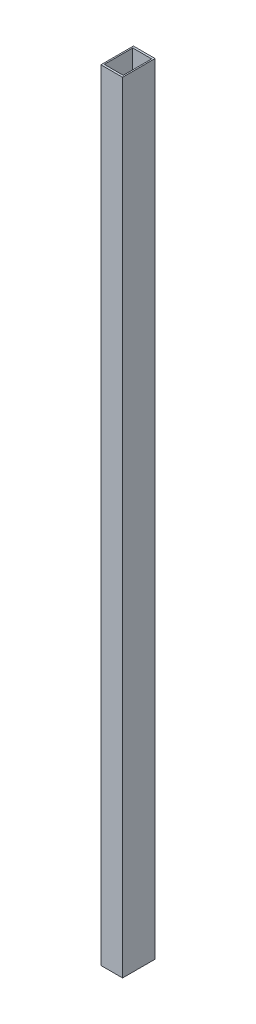
ISO-10303-21;
HEADER;
FILE_DESCRIPTION(('STEP AP214'),'2;1');
FILE_NAME('part.step','',(''),(''),'','','');
FILE_SCHEMA(('AUTOMOTIVE_DESIGN { 1 0 10303 214 1 1 1 1 }'));
ENDSEC;
DATA;
#1=APPLICATION_CONTEXT('core data for automotive mechanical design processes');
#2=APPLICATION_PROTOCOL_DEFINITION('international standard','automotive_design',2000,#1);
#3=PRODUCT_CONTEXT('',#1,'mechanical');
#4=PRODUCT('Part','Part','',(#3));
#5=PRODUCT_RELATED_PRODUCT_CATEGORY('part','',(#4));
#6=PRODUCT_DEFINITION_FORMATION('','',#4);
#7=PRODUCT_DEFINITION_CONTEXT('part definition',#1,'design');
#8=PRODUCT_DEFINITION('design','',#6,#7);
#9=PRODUCT_DEFINITION_SHAPE('','',#8);
#10=(LENGTH_UNIT() NAMED_UNIT(*) SI_UNIT(.MILLI.,.METRE.));
#11=(NAMED_UNIT(*) PLANE_ANGLE_UNIT() SI_UNIT($,.RADIAN.));
#12=(NAMED_UNIT(*) SI_UNIT($,.STERADIAN.) SOLID_ANGLE_UNIT());
#13=UNCERTAINTY_MEASURE_WITH_UNIT(LENGTH_MEASURE(1.E-05),#10,'distance_accuracy_value','');
#14=(GEOMETRIC_REPRESENTATION_CONTEXT(3) GLOBAL_UNCERTAINTY_ASSIGNED_CONTEXT((#13)) GLOBAL_UNIT_ASSIGNED_CONTEXT((#10,
#11,#12)) REPRESENTATION_CONTEXT('',''));
#15=CARTESIAN_POINT('',(0.,0.,0.));
#16=DIRECTION('',(0.,0.,1.));
#17=DIRECTION('',(1.,0.,0.));
#18=AXIS2_PLACEMENT_3D('',#15,#16,#17);
#19=CARTESIAN_POINT('',(-25.4,0.,-38.1));
#20=DIRECTION('',(-1.,0.,0.));
#21=DIRECTION('',(0.,0.,1.));
#22=AXIS2_PLACEMENT_3D('',#19,#20,#21);
#23=PLANE('',#22);
#24=DIRECTION('',(0.,1.,0.));
#25=VECTOR('',#24,1.);
#26=CARTESIAN_POINT('',(-25.4,0.,-38.1));
#27=LINE('',#26,#25);
#28=CARTESIAN_POINT('',(-25.4,0.,-38.1));
#29=VERTEX_POINT('',#28);
#30=CARTESIAN_POINT('',(-25.4,1828.8,-38.1));
#31=VERTEX_POINT('',#30);
#32=EDGE_CURVE('E114',#29,#31,#27,.T.);
#33=ORIENTED_EDGE('',*,*,#32,.F.);
#34=DIRECTION('',(0.,0.,1.));
#35=VECTOR('',#34,1.);
#36=CARTESIAN_POINT('',(-25.4,0.,0.));
#37=LINE('',#36,#35);
#38=CARTESIAN_POINT('',(-25.4,0.,38.1));
#39=VERTEX_POINT('',#38);
#40=EDGE_CURVE('E136',#29,#39,#37,.T.);
#41=ORIENTED_EDGE('',*,*,#40,.T.);
#42=DIRECTION('',(0.,1.,0.));
#43=VECTOR('',#42,1.);
#44=CARTESIAN_POINT('',(-25.4,0.,38.1));
#45=LINE('',#44,#43);
#46=CARTESIAN_POINT('',(-25.4,1828.8,38.1));
#47=VERTEX_POINT('',#46);
#48=EDGE_CURVE('E131',#47,#39,#45,.F.);
#49=ORIENTED_EDGE('',*,*,#48,.F.);
#50=DIRECTION('',(0.,0.,1.));
#51=VECTOR('',#50,1.);
#52=CARTESIAN_POINT('',(-25.4,1828.8,0.));
#53=LINE('',#52,#51);
#54=EDGE_CURVE('E109',#31,#47,#53,.T.);
#55=ORIENTED_EDGE('',*,*,#54,.F.);
#56=EDGE_LOOP('',(#33,#41,#49,#55));
#57=FACE_BOUND('',#56,.T.);
#58=ADVANCED_FACE('F17',(#57),#23,.T.);
#59=CARTESIAN_POINT('',(22.225,0.,-33.3375));
#60=DIRECTION('',(-1.,0.,0.));
#61=DIRECTION('',(0.,0.,1.));
#62=AXIS2_PLACEMENT_3D('',#59,#60,#61);
#63=PLANE('',#62);
#64=DIRECTION('',(0.,1.,0.));
#65=VECTOR('',#64,1.);
#66=CARTESIAN_POINT('',(22.225,0.,-33.3375));
#67=LINE('',#66,#65);
#68=CARTESIAN_POINT('',(22.225,0.,-33.3375));
#69=VERTEX_POINT('',#68);
#70=CARTESIAN_POINT('',(22.225,1828.8,-33.3375));
#71=VERTEX_POINT('',#70);
#72=EDGE_CURVE('E91',#69,#71,#67,.T.);
#73=ORIENTED_EDGE('',*,*,#72,.F.);
#74=DIRECTION('',(0.,0.,1.));
#75=VECTOR('',#74,1.);
#76=CARTESIAN_POINT('',(22.225,0.,0.));
#77=LINE('',#76,#75);
#78=CARTESIAN_POINT('',(22.225,0.,33.3375));
#79=VERTEX_POINT('',#78);
#80=EDGE_CURVE('E139',#69,#79,#77,.T.);
#81=ORIENTED_EDGE('',*,*,#80,.T.);
#82=DIRECTION('',(0.,1.,0.));
#83=VECTOR('',#82,1.);
#84=CARTESIAN_POINT('',(22.225,0.,33.3375));
#85=LINE('',#84,#83);
#86=CARTESIAN_POINT('',(22.225,1828.8,33.3375));
#87=VERTEX_POINT('',#86);
#88=EDGE_CURVE('E20',#87,#79,#85,.F.);
#89=ORIENTED_EDGE('',*,*,#88,.F.);
#90=DIRECTION('',(0.,0.,1.));
#91=VECTOR('',#90,1.);
#92=CARTESIAN_POINT('',(22.225,1828.8,0.));
#93=LINE('',#92,#91);
#94=EDGE_CURVE('E105',#71,#87,#93,.T.);
#95=ORIENTED_EDGE('',*,*,#94,.F.);
#96=EDGE_LOOP('',(#73,#81,#89,#95));
#97=FACE_BOUND('',#96,.T.);
#98=ADVANCED_FACE('F125',(#97),#63,.T.);
#99=CARTESIAN_POINT('',(22.225,0.,33.3375));
#100=DIRECTION('',(0.,0.,-1.));
#101=DIRECTION('',(-1.,0.,0.));
#102=AXIS2_PLACEMENT_3D('',#99,#100,#101);
#103=PLANE('',#102);
#104=ORIENTED_EDGE('',*,*,#88,.T.);
#105=DIRECTION('',(1.,0.,0.));
#106=VECTOR('',#105,1.);
#107=CARTESIAN_POINT('',(0.,0.,33.3375));
#108=LINE('',#107,#106);
#109=CARTESIAN_POINT('',(-22.225,0.,33.3375));
#110=VERTEX_POINT('',#109);
#111=EDGE_CURVE('E88',#79,#110,#108,.F.);
#112=ORIENTED_EDGE('',*,*,#111,.T.);
#113=DIRECTION('',(0.,1.,0.));
#114=VECTOR('',#113,1.);
#115=CARTESIAN_POINT('',(-22.225,0.,33.3375));
#116=LINE('',#115,#114);
#117=CARTESIAN_POINT('',(-22.225,1828.8,33.3375));
#118=VERTEX_POINT('',#117);
#119=EDGE_CURVE('E80',#118,#110,#116,.F.);
#120=ORIENTED_EDGE('',*,*,#119,.F.);
#121=DIRECTION('',(1.,0.,0.));
#122=VECTOR('',#121,1.);
#123=CARTESIAN_POINT('',(0.,1828.8,33.3375));
#124=LINE('',#123,#122);
#125=EDGE_CURVE('E85',#87,#118,#124,.F.);
#126=ORIENTED_EDGE('',*,*,#125,.F.);
#127=EDGE_LOOP('',(#104,#112,#120,#126));
#128=FACE_BOUND('',#127,.T.);
#129=ADVANCED_FACE('F83',(#128),#103,.T.);
#130=CARTESIAN_POINT('',(-22.225,0.,33.3375));
#131=DIRECTION('',(1.,0.,0.));
#132=DIRECTION('',(0.,0.,-1.));
#133=AXIS2_PLACEMENT_3D('',#130,#131,#132);
#134=PLANE('',#133);
#135=ORIENTED_EDGE('',*,*,#119,.T.);
#136=DIRECTION('',(0.,0.,1.));
#137=VECTOR('',#136,1.);
#138=CARTESIAN_POINT('',(-22.225,0.,0.));
#139=LINE('',#138,#137);
#140=CARTESIAN_POINT('',(-22.225,0.,-33.3375));
#141=VERTEX_POINT('',#140);
#142=EDGE_CURVE('E142',#110,#141,#139,.F.);
#143=ORIENTED_EDGE('',*,*,#142,.T.);
#144=DIRECTION('',(0.,1.,0.));
#145=VECTOR('',#144,1.);
#146=CARTESIAN_POINT('',(-22.225,0.,-33.3375));
#147=LINE('',#146,#145);
#148=CARTESIAN_POINT('',(-22.225,1828.8,-33.3375));
#149=VERTEX_POINT('',#148);
#150=EDGE_CURVE('E96',#149,#141,#147,.F.);
#151=ORIENTED_EDGE('',*,*,#150,.F.);
#152=DIRECTION('',(0.,0.,1.));
#153=VECTOR('',#152,1.);
#154=CARTESIAN_POINT('',(-22.225,1828.8,0.));
#155=LINE('',#154,#153);
#156=EDGE_CURVE('E93',#118,#149,#155,.F.);
#157=ORIENTED_EDGE('',*,*,#156,.F.);
#158=EDGE_LOOP('',(#135,#143,#151,#157));
#159=FACE_BOUND('',#158,.T.);
#160=ADVANCED_FACE('F94',(#159),#134,.T.);
#161=CARTESIAN_POINT('',(-22.225,0.,-33.3375));
#162=DIRECTION('',(0.,0.,1.));
#163=DIRECTION('',(1.,0.,0.));
#164=AXIS2_PLACEMENT_3D('',#161,#162,#163);
#165=PLANE('',#164);
#166=ORIENTED_EDGE('',*,*,#150,.T.);
#167=DIRECTION('',(1.,0.,0.));
#168=VECTOR('',#167,1.);
#169=CARTESIAN_POINT('',(0.,0.,-33.3375));
#170=LINE('',#169,#168);
#171=EDGE_CURVE('E122',#141,#69,#170,.T.);
#172=ORIENTED_EDGE('',*,*,#171,.T.);
#173=ORIENTED_EDGE('',*,*,#72,.T.);
#174=DIRECTION('',(1.,0.,0.));
#175=VECTOR('',#174,1.);
#176=CARTESIAN_POINT('',(0.,1828.8,-33.3375));
#177=LINE('',#176,#175);
#178=EDGE_CURVE('E100',#149,#71,#177,.T.);
#179=ORIENTED_EDGE('',*,*,#178,.F.);
#180=EDGE_LOOP('',(#166,#172,#173,#179));
#181=FACE_BOUND('',#180,.T.);
#182=ADVANCED_FACE('F120',(#181),#165,.T.);
#183=CARTESIAN_POINT('',(25.4,0.,-38.1));
#184=DIRECTION('',(0.,0.,-1.));
#185=DIRECTION('',(-1.,0.,0.));
#186=AXIS2_PLACEMENT_3D('',#183,#184,#185);
#187=PLANE('',#186);
#188=DIRECTION('',(0.,1.,0.));
#189=VECTOR('',#188,1.);
#190=CARTESIAN_POINT('',(25.4,0.,-38.1));
#191=LINE('',#190,#189);
#192=CARTESIAN_POINT('',(25.4,0.,-38.1));
#193=VERTEX_POINT('',#192);
#194=CARTESIAN_POINT('',(25.4,1828.8,-38.1));
#195=VERTEX_POINT('',#194);
#196=EDGE_CURVE('E145',#193,#195,#191,.T.);
#197=ORIENTED_EDGE('',*,*,#196,.F.);
#198=DIRECTION('',(1.,0.,0.));
#199=VECTOR('',#198,1.);
#200=CARTESIAN_POINT('',(0.,0.,-38.1));
#201=LINE('',#200,#199);
#202=EDGE_CURVE('E133',#193,#29,#201,.F.);
#203=ORIENTED_EDGE('',*,*,#202,.T.);
#204=ORIENTED_EDGE('',*,*,#32,.T.);
#205=DIRECTION('',(1.,0.,0.));
#206=VECTOR('',#205,1.);
#207=CARTESIAN_POINT('',(0.,1828.8,-38.1));
#208=LINE('',#207,#206);
#209=EDGE_CURVE('E106',#195,#31,#208,.F.);
#210=ORIENTED_EDGE('',*,*,#209,.F.);
#211=EDGE_LOOP('',(#197,#203,#204,#210));
#212=FACE_BOUND('',#211,.T.);
#213=ADVANCED_FACE('F164',(#212),#187,.T.);
#214=CARTESIAN_POINT('',(0.,1828.8,0.));
#215=DIRECTION('',(0.,1.,0.));
#216=DIRECTION('',(0.,0.,1.));
#217=AXIS2_PLACEMENT_3D('',#214,#215,#216);
#218=PLANE('',#217);
#219=ORIENTED_EDGE('',*,*,#178,.T.);
#220=ORIENTED_EDGE('',*,*,#94,.T.);
#221=ORIENTED_EDGE('',*,*,#125,.T.);
#222=ORIENTED_EDGE('',*,*,#156,.T.);
#223=EDGE_LOOP('',(#219,#220,#221,#222));
#224=FACE_BOUND('',#223,.T.);
#225=DIRECTION('',(0.,0.,-1.));
#226=VECTOR('',#225,1.);
#227=CARTESIAN_POINT('',(25.4,1828.8,38.1));
#228=LINE('',#227,#226);
#229=CARTESIAN_POINT('',(25.4,1828.8,38.1));
#230=VERTEX_POINT('',#229);
#231=EDGE_CURVE('E148',#195,#230,#228,.F.);
#232=ORIENTED_EDGE('',*,*,#231,.F.);
#233=ORIENTED_EDGE('',*,*,#209,.T.);
#234=ORIENTED_EDGE('',*,*,#54,.T.);
#235=DIRECTION('',(1.,0.,0.));
#236=VECTOR('',#235,1.);
#237=CARTESIAN_POINT('',(-25.4,1828.8,38.1));
#238=LINE('',#237,#236);
#239=EDGE_CURVE('E126',#230,#47,#238,.F.);
#240=ORIENTED_EDGE('',*,*,#239,.F.);
#241=EDGE_LOOP('',(#232,#233,#234,#240));
#242=FACE_BOUND('',#241,.T.);
#243=ADVANCED_FACE('F102',(#224,#242),#218,.T.);
#244=CARTESIAN_POINT('',(-25.4,0.,38.1));
#245=DIRECTION('',(0.,0.,1.));
#246=DIRECTION('',(1.,0.,0.));
#247=AXIS2_PLACEMENT_3D('',#244,#245,#246);
#248=PLANE('',#247);
#249=ORIENTED_EDGE('',*,*,#48,.T.);
#250=DIRECTION('',(1.,0.,0.));
#251=VECTOR('',#250,1.);
#252=CARTESIAN_POINT('',(0.,0.,38.1));
#253=LINE('',#252,#251);
#254=CARTESIAN_POINT('',(25.4,0.,38.1));
#255=VERTEX_POINT('',#254);
#256=EDGE_CURVE('E35',#39,#255,#253,.T.);
#257=ORIENTED_EDGE('',*,*,#256,.T.);
#258=DIRECTION('',(0.,1.,0.));
#259=VECTOR('',#258,1.);
#260=CARTESIAN_POINT('',(25.4,0.,38.1));
#261=LINE('',#260,#259);
#262=EDGE_CURVE('E26',#230,#255,#261,.F.);
#263=ORIENTED_EDGE('',*,*,#262,.F.);
#264=ORIENTED_EDGE('',*,*,#239,.T.);
#265=EDGE_LOOP('',(#249,#257,#263,#264));
#266=FACE_BOUND('',#265,.T.);
#267=ADVANCED_FACE('F155',(#266),#248,.T.);
#268=CARTESIAN_POINT('',(0.,0.,0.));
#269=DIRECTION('',(0.,1.,0.));
#270=DIRECTION('',(0.,0.,1.));
#271=AXIS2_PLACEMENT_3D('',#268,#269,#270);
#272=PLANE('',#271);
#273=ORIENTED_EDGE('',*,*,#142,.F.);
#274=ORIENTED_EDGE('',*,*,#111,.F.);
#275=ORIENTED_EDGE('',*,*,#80,.F.);
#276=ORIENTED_EDGE('',*,*,#171,.F.);
#277=EDGE_LOOP('',(#273,#274,#275,#276));
#278=FACE_BOUND('',#277,.T.);
#279=ORIENTED_EDGE('',*,*,#256,.F.);
#280=ORIENTED_EDGE('',*,*,#40,.F.);
#281=ORIENTED_EDGE('',*,*,#202,.F.);
#282=DIRECTION('',(0.,0.,-1.));
#283=VECTOR('',#282,1.);
#284=CARTESIAN_POINT('',(25.4,0.,38.1));
#285=LINE('',#284,#283);
#286=EDGE_CURVE('E11',#255,#193,#285,.T.);
#287=ORIENTED_EDGE('',*,*,#286,.F.);
#288=EDGE_LOOP('',(#279,#280,#281,#287));
#289=FACE_BOUND('',#288,.T.);
#290=ADVANCED_FACE('F162',(#278,#289),#272,.F.);
#291=CARTESIAN_POINT('',(25.4,0.,38.1));
#292=DIRECTION('',(1.,0.,0.));
#293=DIRECTION('',(0.,0.,-1.));
#294=AXIS2_PLACEMENT_3D('',#291,#292,#293);
#295=PLANE('',#294);
#296=ORIENTED_EDGE('',*,*,#262,.T.);
#297=ORIENTED_EDGE('',*,*,#286,.T.);
#298=ORIENTED_EDGE('',*,*,#196,.T.);
#299=ORIENTED_EDGE('',*,*,#231,.T.);
#300=EDGE_LOOP('',(#296,#297,#298,#299));
#301=FACE_BOUND('',#300,.T.);
#302=ADVANCED_FACE('F153',(#301),#295,.T.);
#303=CLOSED_SHELL('',(#58,#98,#129,#160,#182,#213,#243,#267,#290,#302));
#304=MANIFOLD_SOLID_BREP('B1',#303);
#305=ADVANCED_BREP_SHAPE_REPRESENTATION('',(#18,#304),#14);
#306=SHAPE_DEFINITION_REPRESENTATION(#9,#305);
ENDSEC;
END-ISO-10303-21;
